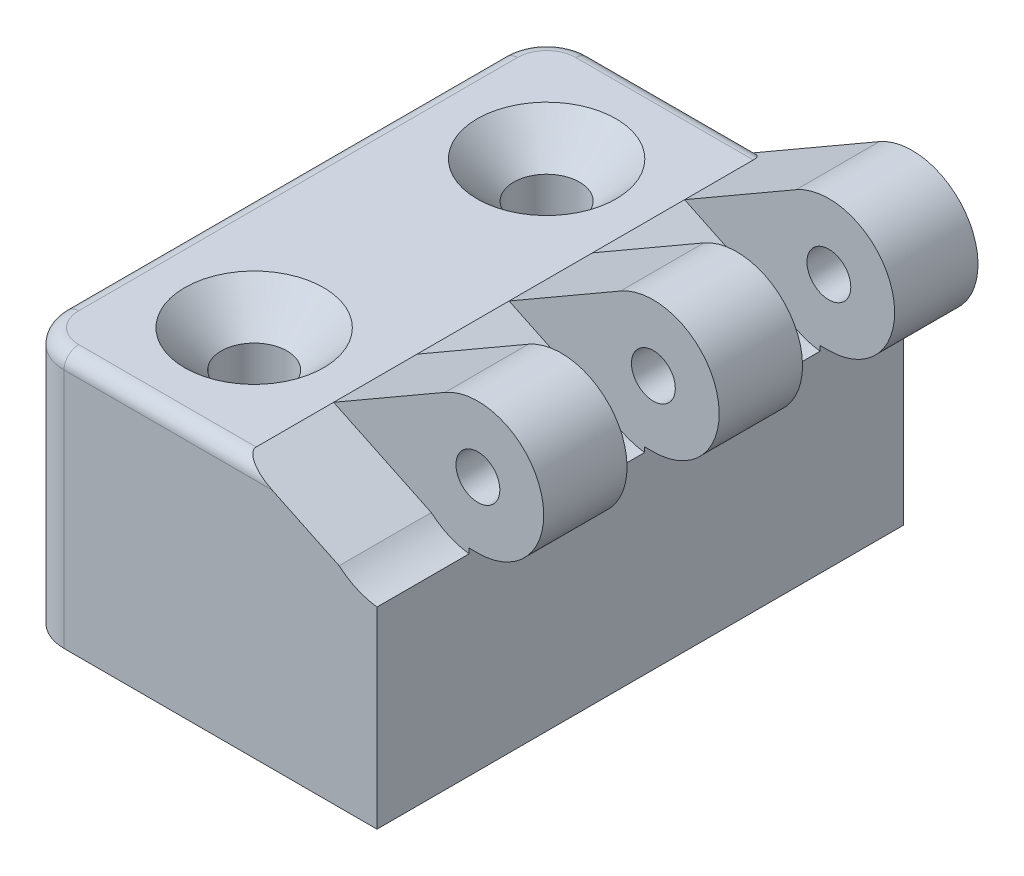
ISO-10303-21;
HEADER;
FILE_DESCRIPTION(('STEP AP214'),'2;1');
FILE_NAME('part.step','',(''),(''),'','','');
FILE_SCHEMA(('AUTOMOTIVE_DESIGN { 1 0 10303 214 1 1 1 1 }'));
ENDSEC;
DATA;
#1=APPLICATION_CONTEXT('core data for automotive mechanical design processes');
#2=APPLICATION_PROTOCOL_DEFINITION('international standard','automotive_design',2000,#1);
#3=PRODUCT_CONTEXT('',#1,'mechanical');
#4=PRODUCT('Part','Part','',(#3));
#5=PRODUCT_RELATED_PRODUCT_CATEGORY('part','',(#4));
#6=PRODUCT_DEFINITION_FORMATION('','',#4);
#7=PRODUCT_DEFINITION_CONTEXT('part definition',#1,'design');
#8=PRODUCT_DEFINITION('design','',#6,#7);
#9=PRODUCT_DEFINITION_SHAPE('','',#8);
#10=(LENGTH_UNIT() NAMED_UNIT(*) SI_UNIT(.MILLI.,.METRE.));
#11=(NAMED_UNIT(*) PLANE_ANGLE_UNIT() SI_UNIT($,.RADIAN.));
#12=(NAMED_UNIT(*) SI_UNIT($,.STERADIAN.) SOLID_ANGLE_UNIT());
#13=UNCERTAINTY_MEASURE_WITH_UNIT(LENGTH_MEASURE(1.E-05),#10,'distance_accuracy_value','');
#14=(GEOMETRIC_REPRESENTATION_CONTEXT(3) GLOBAL_UNCERTAINTY_ASSIGNED_CONTEXT((#13)) GLOBAL_UNIT_ASSIGNED_CONTEXT((#10,
#11,#12)) REPRESENTATION_CONTEXT('',''));
#15=CARTESIAN_POINT('',(0.,0.,0.));
#16=DIRECTION('',(0.,0.,1.));
#17=DIRECTION('',(1.,0.,0.));
#18=AXIS2_PLACEMENT_3D('',#15,#16,#17);
#19=CARTESIAN_POINT('',(12.75,7.89711431702908,-36.));
#20=DIRECTION('',(-0.499999999999995,0.866025403784442,0.));
#21=DIRECTION('',(-0.866025403784442,-0.499999999999995,0.));
#22=AXIS2_PLACEMENT_3D('',#19,#20,#21);
#23=PLANE('',#22);
#24=DIRECTION('',(-0.866025403784442,-0.499999999999995,0.));
#25=VECTOR('',#24,1.);
#26=CARTESIAN_POINT('',(12.75,7.89711431702908,-36.));
#27=LINE('',#26,#25);
#28=CARTESIAN_POINT('',(12.75,7.89711431702908,-36.));
#29=VERTEX_POINT('',#28);
#30=CARTESIAN_POINT('',(3.40192378864723,2.49999999999948,-36.));
#31=VERTEX_POINT('',#30);
#32=EDGE_CURVE('E439',#29,#31,#27,.T.);
#33=ORIENTED_EDGE('',*,*,#32,.T.);
#34=CARTESIAN_POINT('',(3.40192378864724,2.49999999999948,-35.));
#35=DIRECTION('',(-0.499999999999995,0.866025403784442,0.));
#36=DIRECTION('',(0.866025403784442,0.499999999999995,0.));
#37=AXIS2_PLACEMENT_3D('',#34,#35,#36);
#38=ELLIPSE('',#37,2.00000000000002,1.);
#39=CARTESIAN_POINT('',(5.13397459621614,3.49999999999948,-35.));
#40=VERTEX_POINT('',#39);
#41=EDGE_CURVE('E11',#31,#40,#38,.F.);
#42=ORIENTED_EDGE('',*,*,#41,.T.);
#43=DIRECTION('',(0.,0.,1.));
#44=VECTOR('',#43,1.);
#45=CARTESIAN_POINT('',(5.13397459621614,3.49999999999948,-36.));
#46=LINE('',#45,#44);
#47=CARTESIAN_POINT('',(5.13397459621614,3.49999999999948,-30.3));
#48=VERTEX_POINT('',#47);
#49=EDGE_CURVE('E446',#40,#48,#46,.T.);
#50=ORIENTED_EDGE('',*,*,#49,.T.);
#51=DIRECTION('',(-0.866025403784442,-0.499999999999995,0.));
#52=VECTOR('',#51,1.);
#53=CARTESIAN_POINT('',(12.75,7.89711431702908,-30.3));
#54=LINE('',#53,#52);
#55=CARTESIAN_POINT('',(12.75,7.89711431702908,-30.3));
#56=VERTEX_POINT('',#55);
#57=EDGE_CURVE('E270',#56,#48,#54,.T.);
#58=ORIENTED_EDGE('',*,*,#57,.F.);
#59=DIRECTION('',(0.,0.,1.));
#60=VECTOR('',#59,1.);
#61=CARTESIAN_POINT('',(12.75,7.89711431702908,-36.));
#62=LINE('',#61,#60);
#63=EDGE_CURVE('E452',#29,#56,#62,.T.);
#64=ORIENTED_EDGE('',*,*,#63,.F.);
#65=EDGE_LOOP('',(#33,#42,#50,#58,#64));
#66=FACE_BOUND('',#65,.T.);
#67=ADVANCED_FACE('F41',(#66),#23,.T.);
#68=CARTESIAN_POINT('',(15.,3.99999999999909,-36.));
#69=DIRECTION('',(0.,0.,1.));
#70=DIRECTION('',(1.,0.,0.));
#71=AXIS2_PLACEMENT_3D('',#68,#69,#70);
#72=CYLINDRICAL_SURFACE('',#71,4.5);
#73=ORIENTED_EDGE('',*,*,#63,.T.);
#74=CARTESIAN_POINT('',(15.,3.99999999999909,-30.3));
#75=DIRECTION('',(0.,0.,1.));
#76=DIRECTION('',(1.,0.,0.));
#77=AXIS2_PLACEMENT_3D('',#74,#75,#76);
#78=CIRCLE('',#77,4.5);
#79=CARTESIAN_POINT('',(14.9999999999995,-0.500000000000907,-30.3));
#80=VERTEX_POINT('',#79);
#81=EDGE_CURVE('E267',#80,#56,#78,.T.);
#82=ORIENTED_EDGE('',*,*,#81,.F.);
#83=DIRECTION('',(0.,0.,1.));
#84=VECTOR('',#83,1.);
#85=CARTESIAN_POINT('',(14.9999999999995,-0.500000000000907,-36.));
#86=LINE('',#85,#84);
#87=CARTESIAN_POINT('',(14.9999999999995,-0.500000000000907,-36.));
#88=VERTEX_POINT('',#87);
#89=EDGE_CURVE('E458',#88,#80,#86,.T.);
#90=ORIENTED_EDGE('',*,*,#89,.F.);
#91=CARTESIAN_POINT('',(15.,3.99999999999909,-36.));
#92=DIRECTION('',(0.,0.,1.));
#93=DIRECTION('',(1.,0.,0.));
#94=AXIS2_PLACEMENT_3D('',#91,#92,#93);
#95=CIRCLE('',#94,4.5);
#96=EDGE_CURVE('E435',#88,#29,#95,.T.);
#97=ORIENTED_EDGE('',*,*,#96,.T.);
#98=EDGE_LOOP('',(#73,#82,#90,#97));
#99=FACE_BOUND('',#98,.T.);
#100=ADVANCED_FACE('F672',(#99),#72,.T.);
#101=CARTESIAN_POINT('',(14.9999999999995,-0.500000000000907,-36.));
#102=DIRECTION('',(0.,-1.,0.));
#103=DIRECTION('',(1.,0.,0.));
#104=AXIS2_PLACEMENT_3D('',#101,#102,#103);
#105=PLANE('',#104);
#106=ORIENTED_EDGE('',*,*,#89,.T.);
#107=DIRECTION('',(-1.,0.,0.));
#108=VECTOR('',#107,1.);
#109=CARTESIAN_POINT('',(14.9999999999995,-0.500000000000907,-30.3));
#110=LINE('',#109,#108);
#111=CARTESIAN_POINT('',(14.3999999999995,-0.500000000000907,-30.3));
#112=VERTEX_POINT('',#111);
#113=EDGE_CURVE('E315',#80,#112,#110,.T.);
#114=ORIENTED_EDGE('',*,*,#113,.T.);
#115=DIRECTION('',(0.,0.,1.));
#116=VECTOR('',#115,1.);
#117=CARTESIAN_POINT('',(14.3999999999995,-0.500000000000907,-36.));
#118=LINE('',#117,#116);
#119=CARTESIAN_POINT('',(14.3999999999995,-0.500000000000907,-36.));
#120=VERTEX_POINT('',#119);
#121=EDGE_CURVE('E464',#120,#112,#118,.T.);
#122=ORIENTED_EDGE('',*,*,#121,.F.);
#123=DIRECTION('',(1.,0.,0.));
#124=VECTOR('',#123,1.);
#125=CARTESIAN_POINT('',(14.9999999999995,-0.500000000000907,-36.));
#126=LINE('',#125,#124);
#127=EDGE_CURVE('E431',#120,#88,#126,.T.);
#128=ORIENTED_EDGE('',*,*,#127,.T.);
#129=EDGE_LOOP('',(#106,#114,#122,#128));
#130=FACE_BOUND('',#129,.T.);
#131=ADVANCED_FACE('F677',(#130),#105,.T.);
#132=CARTESIAN_POINT('',(15.,3.99999999999909,-36.));
#133=DIRECTION('',(0.,0.,1.));
#134=DIRECTION('',(1.,0.,0.));
#135=AXIS2_PLACEMENT_3D('',#132,#133,#134);
#136=CYLINDRICAL_SURFACE('',#135,1.5);
#137=CARTESIAN_POINT('',(15.,3.99999999999909,-36.));
#138=DIRECTION('',(0.,0.,1.));
#139=DIRECTION('',(1.,0.,0.));
#140=AXIS2_PLACEMENT_3D('',#137,#138,#139);
#141=CIRCLE('',#140,1.5);
#142=CARTESIAN_POINT('',(16.5,3.99999999999909,-36.));
#143=VERTEX_POINT('',#142);
#144=EDGE_CURVE('E422',#143,#143,#141,.T.);
#145=ORIENTED_EDGE('',*,*,#144,.F.);
#146=EDGE_LOOP('',(#145));
#147=FACE_BOUND('',#146,.T.);
#148=CARTESIAN_POINT('',(15.,3.99999999999909,-30.3));
#149=DIRECTION('',(0.,0.,1.));
#150=DIRECTION('',(1.,0.,0.));
#151=AXIS2_PLACEMENT_3D('',#148,#149,#150);
#152=CIRCLE('',#151,1.5);
#153=CARTESIAN_POINT('',(16.5,3.99999999999909,-30.3));
#154=VERTEX_POINT('',#153);
#155=EDGE_CURVE('E319',#154,#154,#152,.F.);
#156=ORIENTED_EDGE('',*,*,#155,.F.);
#157=EDGE_LOOP('',(#156));
#158=FACE_BOUND('',#157,.T.);
#159=ADVANCED_FACE('F691',(#147,#158),#136,.F.);
#160=CARTESIAN_POINT('',(14.3999999999995,-0.500000000000907,-36.));
#161=DIRECTION('',(1.,0.,0.));
#162=DIRECTION('',(0.,1.,0.));
#163=AXIS2_PLACEMENT_3D('',#160,#161,#162);
#164=PLANE('',#163);
#165=ORIENTED_EDGE('',*,*,#121,.T.);
#166=DIRECTION('',(0.,-1.,0.));
#167=VECTOR('',#166,1.);
#168=CARTESIAN_POINT('',(14.3999999999995,-0.500000000000907,-30.3));
#169=LINE('',#168,#167);
#170=CARTESIAN_POINT('',(14.3999999999996,-0.842600763875235,-30.3));
#171=VERTEX_POINT('',#170);
#172=EDGE_CURVE('E481',#112,#171,#169,.T.);
#173=ORIENTED_EDGE('',*,*,#172,.T.);
#174=DIRECTION('',(0.,0.,1.));
#175=VECTOR('',#174,1.);
#176=CARTESIAN_POINT('',(14.3999999999996,-0.842600763875235,-30.3));
#177=LINE('',#176,#175);
#178=CARTESIAN_POINT('',(14.3999999999996,-0.842600763875235,-24.));
#179=VERTEX_POINT('',#178);
#180=EDGE_CURVE('E299',#171,#179,#177,.T.);
#181=ORIENTED_EDGE('',*,*,#180,.T.);
#182=DIRECTION('',(0.,-1.,0.));
#183=VECTOR('',#182,1.);
#184=CARTESIAN_POINT('',(14.3999999999995,-0.500000000000907,-24.));
#185=LINE('',#184,#183);
#186=CARTESIAN_POINT('',(14.3999999999995,-0.500000000000907,-24.));
#187=VERTEX_POINT('',#186);
#188=EDGE_CURVE('E478',#187,#179,#185,.T.);
#189=ORIENTED_EDGE('',*,*,#188,.F.);
#190=CARTESIAN_POINT('',(14.3999999999995,-0.500000000000907,-18.3));
#191=VERTEX_POINT('',#190);
#192=EDGE_CURVE('E468',#187,#191,#118,.T.);
#193=ORIENTED_EDGE('',*,*,#192,.T.);
#194=DIRECTION('',(0.,-1.,0.));
#195=VECTOR('',#194,1.);
#196=CARTESIAN_POINT('',(14.3999999999995,-0.500000000000907,-18.3));
#197=LINE('',#196,#195);
#198=CARTESIAN_POINT('',(14.3999999999996,-0.842600763875235,-18.3));
#199=VERTEX_POINT('',#198);
#200=EDGE_CURVE('E474',#191,#199,#197,.T.);
#201=ORIENTED_EDGE('',*,*,#200,.T.);
#202=DIRECTION('',(0.,0.,1.));
#203=VECTOR('',#202,1.);
#204=CARTESIAN_POINT('',(14.3999999999996,-0.842600763875235,-18.3));
#205=LINE('',#204,#203);
#206=CARTESIAN_POINT('',(14.3999999999996,-0.842600763875235,-12.));
#207=VERTEX_POINT('',#206);
#208=EDGE_CURVE('E356',#199,#207,#205,.T.);
#209=ORIENTED_EDGE('',*,*,#208,.T.);
#210=DIRECTION('',(0.,-1.,0.));
#211=VECTOR('',#210,1.);
#212=CARTESIAN_POINT('',(14.3999999999995,-0.500000000000907,-12.));
#213=LINE('',#212,#211);
#214=CARTESIAN_POINT('',(14.3999999999995,-0.500000000000907,-12.));
#215=VERTEX_POINT('',#214);
#216=EDGE_CURVE('E449',#215,#207,#213,.T.);
#217=ORIENTED_EDGE('',*,*,#216,.F.);
#218=CARTESIAN_POINT('',(14.3999999999995,-0.500000000000907,-6.3));
#219=VERTEX_POINT('',#218);
#220=EDGE_CURVE('E442',#215,#219,#118,.T.);
#221=ORIENTED_EDGE('',*,*,#220,.T.);
#222=DIRECTION('',(0.,-1.,0.));
#223=VECTOR('',#222,1.);
#224=CARTESIAN_POINT('',(14.3999999999995,-0.500000000000907,-6.3));
#225=LINE('',#224,#223);
#226=CARTESIAN_POINT('',(14.3999999999996,-0.842600763875235,-6.3));
#227=VERTEX_POINT('',#226);
#228=EDGE_CURVE('E414',#219,#227,#225,.T.);
#229=ORIENTED_EDGE('',*,*,#228,.T.);
#230=DIRECTION('',(0.,0.,1.));
#231=VECTOR('',#230,1.);
#232=CARTESIAN_POINT('',(14.3999999999996,-0.842600763875235,-6.3));
#233=LINE('',#232,#231);
#234=CARTESIAN_POINT('',(14.3999999999996,-0.842600763875235,0.));
#235=VERTEX_POINT('',#234);
#236=EDGE_CURVE('E403',#227,#235,#233,.T.);
#237=ORIENTED_EDGE('',*,*,#236,.T.);
#238=DIRECTION('',(0.,1.,0.));
#239=VECTOR('',#238,1.);
#240=CARTESIAN_POINT('',(14.3999999999995,-0.500000000000907,0.));
#241=LINE('',#240,#239);
#242=CARTESIAN_POINT('',(14.3999999999997,-14.0000000000005,0.));
#243=VERTEX_POINT('',#242);
#244=EDGE_CURVE('E426',#243,#235,#241,.T.);
#245=ORIENTED_EDGE('',*,*,#244,.F.);
#246=DIRECTION('',(0.,0.,1.));
#247=VECTOR('',#246,1.);
#248=CARTESIAN_POINT('',(14.3999999999997,-14.0000000000005,-36.));
#249=LINE('',#248,#247);
#250=CARTESIAN_POINT('',(14.3999999999997,-14.0000000000005,-36.));
#251=VERTEX_POINT('',#250);
#252=EDGE_CURVE('E261',#251,#243,#249,.T.);
#253=ORIENTED_EDGE('',*,*,#252,.F.);
#254=DIRECTION('',(0.,1.,0.));
#255=VECTOR('',#254,1.);
#256=CARTESIAN_POINT('',(14.3999999999995,-0.500000000000907,-36.));
#257=LINE('',#256,#255);
#258=EDGE_CURVE('E427',#251,#120,#257,.T.);
#259=ORIENTED_EDGE('',*,*,#258,.T.);
#260=EDGE_LOOP('',(#165,#173,#181,#189,#193,#201,#209,#217,#221,#229,#237,#245,#253,#259));
#261=FACE_BOUND('',#260,.T.);
#262=ADVANCED_FACE('F621',(#261),#164,.T.);
#263=DIRECTION('',(-0.866025403784442,-0.499999999999995,0.));
#264=VECTOR('',#263,1.);
#265=CARTESIAN_POINT('',(12.75,7.89711431702908,-24.));
#266=LINE('',#265,#264);
#267=CARTESIAN_POINT('',(12.75,7.89711431702908,-24.));
#268=VERTEX_POINT('',#267);
#269=CARTESIAN_POINT('',(5.13397459621614,3.49999999999948,-24.));
#270=VERTEX_POINT('',#269);
#271=EDGE_CURVE('E288',#268,#270,#266,.T.);
#272=ORIENTED_EDGE('',*,*,#271,.T.);
#273=CARTESIAN_POINT('',(5.13397459621614,3.49999999999948,-18.3));
#274=VERTEX_POINT('',#273);
#275=EDGE_CURVE('E450',#270,#274,#46,.T.);
#276=ORIENTED_EDGE('',*,*,#275,.T.);
#277=DIRECTION('',(-0.866025403784442,-0.499999999999995,0.));
#278=VECTOR('',#277,1.);
#279=CARTESIAN_POINT('',(12.75,7.89711431702908,-18.3));
#280=LINE('',#279,#278);
#281=CARTESIAN_POINT('',(12.75,7.89711431702908,-18.3));
#282=VERTEX_POINT('',#281);
#283=EDGE_CURVE('E328',#282,#274,#280,.T.);
#284=ORIENTED_EDGE('',*,*,#283,.F.);
#285=EDGE_CURVE('E456',#268,#282,#62,.T.);
#286=ORIENTED_EDGE('',*,*,#285,.F.);
#287=EDGE_LOOP('',(#272,#276,#284,#286));
#288=FACE_BOUND('',#287,.T.);
#289=ADVANCED_FACE('F586',(#288),#23,.T.);
#290=CARTESIAN_POINT('',(15.,3.99999999999909,-24.));
#291=DIRECTION('',(0.,0.,1.));
#292=DIRECTION('',(1.,0.,0.));
#293=AXIS2_PLACEMENT_3D('',#290,#291,#292);
#294=CIRCLE('',#293,4.5);
#295=CARTESIAN_POINT('',(14.9999999999995,-0.500000000000907,-24.));
#296=VERTEX_POINT('',#295);
#297=EDGE_CURVE('E284',#296,#268,#294,.T.);
#298=ORIENTED_EDGE('',*,*,#297,.T.);
#299=ORIENTED_EDGE('',*,*,#285,.T.);
#300=CARTESIAN_POINT('',(15.,3.99999999999909,-18.3));
#301=DIRECTION('',(0.,0.,1.));
#302=DIRECTION('',(1.,0.,0.));
#303=AXIS2_PLACEMENT_3D('',#300,#301,#302);
#304=CIRCLE('',#303,4.5);
#305=CARTESIAN_POINT('',(14.9999999999995,-0.500000000000907,-18.3));
#306=VERTEX_POINT('',#305);
#307=EDGE_CURVE('E324',#306,#282,#304,.T.);
#308=ORIENTED_EDGE('',*,*,#307,.F.);
#309=EDGE_CURVE('E462',#296,#306,#86,.T.);
#310=ORIENTED_EDGE('',*,*,#309,.F.);
#311=EDGE_LOOP('',(#298,#299,#308,#310));
#312=FACE_BOUND('',#311,.T.);
#313=ADVANCED_FACE('F601',(#312),#72,.T.);
#314=DIRECTION('',(-1.,0.,0.));
#315=VECTOR('',#314,1.);
#316=CARTESIAN_POINT('',(14.9999999999995,-0.500000000000907,-24.));
#317=LINE('',#316,#315);
#318=EDGE_CURVE('E303',#296,#187,#317,.T.);
#319=ORIENTED_EDGE('',*,*,#318,.F.);
#320=ORIENTED_EDGE('',*,*,#309,.T.);
#321=DIRECTION('',(-1.,0.,0.));
#322=VECTOR('',#321,1.);
#323=CARTESIAN_POINT('',(14.9999999999995,-0.500000000000907,-18.3));
#324=LINE('',#323,#322);
#325=EDGE_CURVE('E372',#306,#191,#324,.T.);
#326=ORIENTED_EDGE('',*,*,#325,.T.);
#327=ORIENTED_EDGE('',*,*,#192,.F.);
#328=EDGE_LOOP('',(#319,#320,#326,#327));
#329=FACE_BOUND('',#328,.T.);
#330=ADVANCED_FACE('F624',(#329),#105,.T.);
#331=CARTESIAN_POINT('',(15.,3.99999999999909,-24.));
#332=DIRECTION('',(0.,0.,1.));
#333=DIRECTION('',(1.,0.,0.));
#334=AXIS2_PLACEMENT_3D('',#331,#332,#333);
#335=CIRCLE('',#334,1.5);
#336=CARTESIAN_POINT('',(16.5,3.99999999999909,-24.));
#337=VERTEX_POINT('',#336);
#338=EDGE_CURVE('E311',#337,#337,#335,.F.);
#339=ORIENTED_EDGE('',*,*,#338,.T.);
#340=EDGE_LOOP('',(#339));
#341=FACE_BOUND('',#340,.T.);
#342=CARTESIAN_POINT('',(15.,3.99999999999909,-18.3));
#343=DIRECTION('',(0.,0.,1.));
#344=DIRECTION('',(1.,0.,0.));
#345=AXIS2_PLACEMENT_3D('',#342,#343,#344);
#346=CIRCLE('',#345,1.5);
#347=CARTESIAN_POINT('',(16.5,3.99999999999909,-18.3));
#348=VERTEX_POINT('',#347);
#349=EDGE_CURVE('E376',#348,#348,#346,.F.);
#350=ORIENTED_EDGE('',*,*,#349,.F.);
#351=EDGE_LOOP('',(#350));
#352=FACE_BOUND('',#351,.T.);
#353=ADVANCED_FACE('F683',(#341,#352),#136,.F.);
#354=DIRECTION('',(-0.866025403784442,-0.499999999999995,0.));
#355=VECTOR('',#354,1.);
#356=CARTESIAN_POINT('',(12.75,7.89711431702908,-12.));
#357=LINE('',#356,#355);
#358=CARTESIAN_POINT('',(12.75,7.89711431702908,-12.));
#359=VERTEX_POINT('',#358);
#360=CARTESIAN_POINT('',(5.13397459621614,3.49999999999948,-12.));
#361=VERTEX_POINT('',#360);
#362=EDGE_CURVE('E345',#359,#361,#357,.T.);
#363=ORIENTED_EDGE('',*,*,#362,.T.);
#364=CARTESIAN_POINT('',(5.13397459621614,3.49999999999948,-6.3));
#365=VERTEX_POINT('',#364);
#366=EDGE_CURVE('E451',#361,#365,#46,.T.);
#367=ORIENTED_EDGE('',*,*,#366,.T.);
#368=DIRECTION('',(-0.866025403784442,-0.499999999999995,0.));
#369=VECTOR('',#368,1.);
#370=CARTESIAN_POINT('',(12.75,7.89711431702908,-6.3));
#371=LINE('',#370,#369);
#372=CARTESIAN_POINT('',(12.75,7.89711431702908,-6.3));
#373=VERTEX_POINT('',#372);
#374=EDGE_CURVE('E385',#373,#365,#371,.T.);
#375=ORIENTED_EDGE('',*,*,#374,.F.);
#376=EDGE_CURVE('E457',#359,#373,#62,.T.);
#377=ORIENTED_EDGE('',*,*,#376,.F.);
#378=EDGE_LOOP('',(#363,#367,#375,#377));
#379=FACE_BOUND('',#378,.T.);
#380=ADVANCED_FACE('F578',(#379),#23,.T.);
#381=CARTESIAN_POINT('',(15.,3.99999999999909,-12.));
#382=DIRECTION('',(0.,0.,1.));
#383=DIRECTION('',(1.,0.,0.));
#384=AXIS2_PLACEMENT_3D('',#381,#382,#383);
#385=CIRCLE('',#384,4.5);
#386=CARTESIAN_POINT('',(14.9999999999995,-0.500000000000907,-12.));
#387=VERTEX_POINT('',#386);
#388=EDGE_CURVE('E323',#387,#359,#385,.T.);
#389=ORIENTED_EDGE('',*,*,#388,.T.);
#390=ORIENTED_EDGE('',*,*,#376,.T.);
#391=CARTESIAN_POINT('',(15.,3.99999999999909,-6.3));
#392=DIRECTION('',(0.,0.,1.));
#393=DIRECTION('',(1.,0.,0.));
#394=AXIS2_PLACEMENT_3D('',#391,#392,#393);
#395=CIRCLE('',#394,4.5);
#396=CARTESIAN_POINT('',(14.9999999999995,-0.500000000000907,-6.3));
#397=VERTEX_POINT('',#396);
#398=EDGE_CURVE('E381',#397,#373,#395,.T.);
#399=ORIENTED_EDGE('',*,*,#398,.F.);
#400=EDGE_CURVE('E463',#387,#397,#86,.T.);
#401=ORIENTED_EDGE('',*,*,#400,.F.);
#402=EDGE_LOOP('',(#389,#390,#399,#401));
#403=FACE_BOUND('',#402,.T.);
#404=ADVANCED_FACE('F605',(#403),#72,.T.);
#405=DIRECTION('',(-1.,0.,0.));
#406=VECTOR('',#405,1.);
#407=CARTESIAN_POINT('',(14.9999999999995,-0.500000000000907,-12.));
#408=LINE('',#407,#406);
#409=EDGE_CURVE('E360',#387,#215,#408,.T.);
#410=ORIENTED_EDGE('',*,*,#409,.F.);
#411=ORIENTED_EDGE('',*,*,#400,.T.);
#412=DIRECTION('',(-1.,0.,0.));
#413=VECTOR('',#412,1.);
#414=CARTESIAN_POINT('',(14.9999999999995,-0.500000000000907,-6.3));
#415=LINE('',#414,#413);
#416=EDGE_CURVE('E418',#397,#219,#415,.T.);
#417=ORIENTED_EDGE('',*,*,#416,.T.);
#418=ORIENTED_EDGE('',*,*,#220,.F.);
#419=EDGE_LOOP('',(#410,#411,#417,#418));
#420=FACE_BOUND('',#419,.T.);
#421=ADVANCED_FACE('F614',(#420),#105,.T.);
#422=CARTESIAN_POINT('',(15.,3.99999999999909,-12.));
#423=DIRECTION('',(0.,0.,1.));
#424=DIRECTION('',(1.,0.,0.));
#425=AXIS2_PLACEMENT_3D('',#422,#423,#424);
#426=CIRCLE('',#425,1.5);
#427=CARTESIAN_POINT('',(16.5,3.99999999999909,-12.));
#428=VERTEX_POINT('',#427);
#429=EDGE_CURVE('E368',#428,#428,#426,.F.);
#430=ORIENTED_EDGE('',*,*,#429,.T.);
#431=EDGE_LOOP('',(#430));
#432=FACE_BOUND('',#431,.T.);
#433=CARTESIAN_POINT('',(15.,3.99999999999909,-6.3));
#434=DIRECTION('',(0.,0.,1.));
#435=DIRECTION('',(1.,0.,0.));
#436=AXIS2_PLACEMENT_3D('',#433,#434,#435);
#437=CIRCLE('',#436,1.5);
#438=CARTESIAN_POINT('',(16.5,3.99999999999909,-6.3));
#439=VERTEX_POINT('',#438);
#440=EDGE_CURVE('E407',#439,#439,#437,.F.);
#441=ORIENTED_EDGE('',*,*,#440,.F.);
#442=EDGE_LOOP('',(#441));
#443=FACE_BOUND('',#442,.T.);
#444=ADVANCED_FACE('F690',(#432,#443),#136,.F.);
#445=CARTESIAN_POINT('',(-9.99999999999999,-4.00000000000065,-36.));
#446=DIRECTION('',(-1.,0.,0.));
#447=DIRECTION('',(0.,0.,1.));
#448=AXIS2_PLACEMENT_3D('',#445,#446,#447);
#449=PLANE('',#448);
#450=DIRECTION('',(0.,-1.,0.));
#451=VECTOR('',#450,1.);
#452=CARTESIAN_POINT('',(-9.99999999999999,-4.00000000000065,-3.));
#453=LINE('',#452,#451);
#454=CARTESIAN_POINT('',(-9.99999999999994,-14.0000000000006,-3.));
#455=VERTEX_POINT('',#454);
#456=CARTESIAN_POINT('',(-9.99999999999999,2.49999999999948,-3.));
#457=VERTEX_POINT('',#456);
#458=EDGE_CURVE('E219',#455,#457,#453,.F.);
#459=ORIENTED_EDGE('',*,*,#458,.T.);
#460=DIRECTION('',(0.,0.,1.));
#461=VECTOR('',#460,1.);
#462=CARTESIAN_POINT('',(-9.99999999999999,2.49999999999948,-36.));
#463=LINE('',#462,#461);
#464=CARTESIAN_POINT('',(-9.99999999999999,2.49999999999948,-33.));
#465=VERTEX_POINT('',#464);
#466=EDGE_CURVE('E51',#457,#465,#463,.F.);
#467=ORIENTED_EDGE('',*,*,#466,.T.);
#468=DIRECTION('',(0.,-1.,0.));
#469=VECTOR('',#468,1.);
#470=CARTESIAN_POINT('',(-9.99999999999999,-4.00000000000065,-33.));
#471=LINE('',#470,#469);
#472=CARTESIAN_POINT('',(-9.99999999999994,-14.0000000000006,-33.));
#473=VERTEX_POINT('',#472);
#474=EDGE_CURVE('E227',#465,#473,#471,.T.);
#475=ORIENTED_EDGE('',*,*,#474,.T.);
#476=DIRECTION('',(0.,0.,-1.));
#477=VECTOR('',#476,1.);
#478=CARTESIAN_POINT('',(-9.99999999999994,-14.0000000000006,-3.));
#479=LINE('',#478,#477);
#480=EDGE_CURVE('E231',#455,#473,#479,.T.);
#481=ORIENTED_EDGE('',*,*,#480,.F.);
#482=EDGE_LOOP('',(#459,#467,#475,#481));
#483=FACE_BOUND('',#482,.T.);
#484=ADVANCED_FACE('F232',(#483),#449,.T.);
#485=CARTESIAN_POINT('',(-9.99999999999999,3.49999999999948,-36.));
#486=DIRECTION('',(0.,1.,0.));
#487=DIRECTION('',(-1.,0.,0.));
#488=AXIS2_PLACEMENT_3D('',#485,#486,#487);
#489=PLANE('',#488);
#490=ORIENTED_EDGE('',*,*,#49,.F.);
#491=DIRECTION('',(-1.,0.,0.));
#492=VECTOR('',#491,1.);
#493=CARTESIAN_POINT('',(-6.99999999999999,3.49999999999948,-35.));
#494=LINE('',#493,#492);
#495=CARTESIAN_POINT('',(-6.99999999999999,3.49999999999948,-35.));
#496=VERTEX_POINT('',#495);
#497=EDGE_CURVE('E521',#40,#496,#494,.T.);
#498=ORIENTED_EDGE('',*,*,#497,.T.);
#499=CARTESIAN_POINT('',(-6.99999999999999,3.49999999999948,-33.));
#500=DIRECTION('',(0.,1.,0.));
#501=DIRECTION('',(-1.,0.,0.));
#502=AXIS2_PLACEMENT_3D('',#499,#500,#501);
#503=CIRCLE('',#502,2.);
#504=CARTESIAN_POINT('',(-8.99999999999999,3.49999999999948,-33.));
#505=VERTEX_POINT('',#504);
#506=EDGE_CURVE('E518',#496,#505,#503,.T.);
#507=ORIENTED_EDGE('',*,*,#506,.T.);
#508=DIRECTION('',(0.,0.,1.));
#509=VECTOR('',#508,1.);
#510=CARTESIAN_POINT('',(-8.99999999999999,3.49999999999948,-36.));
#511=LINE('',#510,#509);
#512=CARTESIAN_POINT('',(-8.99999999999999,3.49999999999948,-3.));
#513=VERTEX_POINT('',#512);
#514=EDGE_CURVE('E509',#505,#513,#511,.T.);
#515=ORIENTED_EDGE('',*,*,#514,.T.);
#516=CARTESIAN_POINT('',(-6.99999999999999,3.49999999999948,-3.));
#517=DIRECTION('',(0.,1.,0.));
#518=DIRECTION('',(-1.,0.,0.));
#519=AXIS2_PLACEMENT_3D('',#516,#517,#518);
#520=CIRCLE('',#519,2.);
#521=CARTESIAN_POINT('',(-6.99999999999999,3.49999999999948,-1.));
#522=VERTEX_POINT('',#521);
#523=EDGE_CURVE('E512',#513,#522,#520,.T.);
#524=ORIENTED_EDGE('',*,*,#523,.T.);
#525=DIRECTION('',(-1.,0.,0.));
#526=VECTOR('',#525,1.);
#527=CARTESIAN_POINT('',(-9.99999999999999,3.49999999999948,-1.));
#528=LINE('',#527,#526);
#529=CARTESIAN_POINT('',(5.13397459621614,3.49999999999948,-1.));
#530=VERTEX_POINT('',#529);
#531=EDGE_CURVE('E515',#522,#530,#528,.F.);
#532=ORIENTED_EDGE('',*,*,#531,.T.);
#533=DIRECTION('',(0.,0.,1.));
#534=VECTOR('',#533,1.);
#535=CARTESIAN_POINT('',(5.13397459621614,3.49999999999948,-6.3));
#536=LINE('',#535,#534);
#537=EDGE_CURVE('E398',#365,#530,#536,.T.);
#538=ORIENTED_EDGE('',*,*,#537,.F.);
#539=ORIENTED_EDGE('',*,*,#366,.F.);
#540=DIRECTION('',(0.,0.,1.));
#541=VECTOR('',#540,1.);
#542=CARTESIAN_POINT('',(5.13397459621614,3.49999999999948,-18.3));
#543=LINE('',#542,#541);
#544=EDGE_CURVE('E341',#274,#361,#543,.T.);
#545=ORIENTED_EDGE('',*,*,#544,.F.);
#546=ORIENTED_EDGE('',*,*,#275,.F.);
#547=DIRECTION('',(0.,0.,1.));
#548=VECTOR('',#547,1.);
#549=CARTESIAN_POINT('',(5.13397459621614,3.49999999999948,-30.3));
#550=LINE('',#549,#548);
#551=EDGE_CURVE('E283',#48,#270,#550,.T.);
#552=ORIENTED_EDGE('',*,*,#551,.F.);
#553=EDGE_LOOP('',(#490,#498,#507,#515,#524,#532,#538,#539,#545,#546,#552));
#554=FACE_BOUND('',#553,.T.);
#555=CARTESIAN_POINT('',(-1.99999999999999,3.49999999999948,-8.));
#556=DIRECTION('',(0.,1.,0.));
#557=DIRECTION('',(-1.,0.,0.));
#558=AXIS2_PLACEMENT_3D('',#555,#556,#557);
#559=CIRCLE('',#558,4.75000000000002);
#560=CARTESIAN_POINT('',(-6.75000000000001,3.49999999999948,-8.));
#561=VERTEX_POINT('',#560);
#562=EDGE_CURVE('E493',#561,#561,#559,.F.);
#563=ORIENTED_EDGE('',*,*,#562,.T.);
#564=EDGE_LOOP('',(#563));
#565=FACE_BOUND('',#564,.T.);
#566=CARTESIAN_POINT('',(-1.99999999999999,3.49999999999948,-28.));
#567=DIRECTION('',(0.,1.,0.));
#568=DIRECTION('',(-1.,0.,0.));
#569=AXIS2_PLACEMENT_3D('',#566,#567,#568);
#570=CIRCLE('',#569,4.75000000000002);
#571=CARTESIAN_POINT('',(-6.75000000000001,3.49999999999948,-28.));
#572=VERTEX_POINT('',#571);
#573=EDGE_CURVE('E489',#572,#572,#570,.F.);
#574=ORIENTED_EDGE('',*,*,#573,.T.);
#575=EDGE_LOOP('',(#574));
#576=FACE_BOUND('',#575,.T.);
#577=ADVANCED_FACE('F564',(#554,#565,#576),#489,.T.);
#578=CARTESIAN_POINT('',(15.,3.99999999999909,-36.));
#579=DIRECTION('',(0.,0.,1.));
#580=DIRECTION('',(1.,0.,0.));
#581=AXIS2_PLACEMENT_3D('',#578,#579,#580);
#582=PLANE('',#581);
#583=ORIENTED_EDGE('',*,*,#144,.T.);
#584=EDGE_LOOP('',(#583));
#585=FACE_BOUND('',#584,.T.);
#586=DIRECTION('',(0.,-1.,0.));
#587=VECTOR('',#586,1.);
#588=CARTESIAN_POINT('',(-6.99999999999999,3.49999999999948,-36.));
#589=LINE('',#588,#587);
#590=CARTESIAN_POINT('',(-6.99999999999994,-14.0000000000006,-36.));
#591=VERTEX_POINT('',#590);
#592=CARTESIAN_POINT('',(-6.99999999999999,2.49999999999948,-36.));
#593=VERTEX_POINT('',#592);
#594=EDGE_CURVE('E502',#591,#593,#589,.F.);
#595=ORIENTED_EDGE('',*,*,#594,.T.);
#596=DIRECTION('',(-1.,0.,0.));
#597=VECTOR('',#596,1.);
#598=CARTESIAN_POINT('',(5.13397459621614,2.49999999999948,-36.));
#599=LINE('',#598,#597);
#600=EDGE_CURVE('E525',#593,#31,#599,.F.);
#601=ORIENTED_EDGE('',*,*,#600,.T.);
#602=ORIENTED_EDGE('',*,*,#32,.F.);
#603=ORIENTED_EDGE('',*,*,#96,.F.);
#604=ORIENTED_EDGE('',*,*,#127,.F.);
#605=ORIENTED_EDGE('',*,*,#258,.F.);
#606=DIRECTION('',(1.,0.,0.));
#607=VECTOR('',#606,1.);
#608=CARTESIAN_POINT('',(-6.99999999999994,-14.0000000000006,-36.));
#609=LINE('',#608,#607);
#610=EDGE_CURVE('E257',#591,#251,#609,.T.);
#611=ORIENTED_EDGE('',*,*,#610,.F.);
#612=EDGE_LOOP('',(#595,#601,#602,#603,#604,#605,#611));
#613=FACE_BOUND('',#612,.T.);
#614=ADVANCED_FACE('F654',(#585,#613),#582,.F.);
#615=CARTESIAN_POINT('',(15.,3.99999999999909,0.));
#616=DIRECTION('',(0.,0.,1.));
#617=DIRECTION('',(1.,0.,0.));
#618=AXIS2_PLACEMENT_3D('',#615,#616,#617);
#619=PLANE('',#618);
#620=DIRECTION('',(0.90220196879568,-0.431313815569591,0.));
#621=VECTOR('',#620,1.);
#622=CARTESIAN_POINT('',(5.13397459621614,3.49999999999948,0.));
#623=LINE('',#622,#621);
#624=CARTESIAN_POINT('',(7.2257275988512,2.49999999999948,0.));
#625=VERTEX_POINT('',#624);
#626=CARTESIAN_POINT('',(11.8076100498392,0.309549002574857,0.));
#627=VERTEX_POINT('',#626);
#628=EDGE_CURVE('E380',#625,#627,#623,.T.);
#629=ORIENTED_EDGE('',*,*,#628,.F.);
#630=DIRECTION('',(-1.,0.,0.));
#631=VECTOR('',#630,1.);
#632=CARTESIAN_POINT('',(15.,2.49999999999948,0.));
#633=LINE('',#632,#631);
#634=CARTESIAN_POINT('',(-6.99999999999999,2.49999999999948,0.));
#635=VERTEX_POINT('',#634);
#636=EDGE_CURVE('E532',#625,#635,#633,.T.);
#637=ORIENTED_EDGE('',*,*,#636,.T.);
#638=DIRECTION('',(0.,-1.,0.));
#639=VECTOR('',#638,1.);
#640=CARTESIAN_POINT('',(-6.99999999999999,3.99999999999909,0.));
#641=LINE('',#640,#639);
#642=CARTESIAN_POINT('',(-6.99999999999994,-14.0000000000006,0.));
#643=VERTEX_POINT('',#642);
#644=EDGE_CURVE('E506',#635,#643,#641,.T.);
#645=ORIENTED_EDGE('',*,*,#644,.T.);
#646=DIRECTION('',(-1.,0.,0.));
#647=VECTOR('',#646,1.);
#648=CARTESIAN_POINT('',(14.3999999999997,-14.0000000000005,0.));
#649=LINE('',#648,#647);
#650=EDGE_CURVE('E245',#243,#643,#649,.T.);
#651=ORIENTED_EDGE('',*,*,#650,.F.);
#652=ORIENTED_EDGE('',*,*,#244,.T.);
#653=CARTESIAN_POINT('',(15.,3.99999999999909,0.));
#654=DIRECTION('',(0.,0.,1.));
#655=DIRECTION('',(-1.,0.,0.));
#656=AXIS2_PLACEMENT_3D('',#653,#654,#655);
#657=CIRCLE('',#656,4.87962930541625);
#658=EDGE_CURVE('E386',#627,#235,#657,.T.);
#659=ORIENTED_EDGE('',*,*,#658,.F.);
#660=EDGE_LOOP('',(#629,#637,#645,#651,#652,#659));
#661=FACE_BOUND('',#660,.T.);
#662=ADVANCED_FACE('F660',(#661),#619,.T.);
#663=CARTESIAN_POINT('',(15.,3.99999999999909,-6.3));
#664=DIRECTION('',(0.,0.,1.));
#665=DIRECTION('',(1.,0.,0.));
#666=AXIS2_PLACEMENT_3D('',#663,#664,#665);
#667=PLANE('',#666);
#668=ORIENTED_EDGE('',*,*,#398,.T.);
#669=ORIENTED_EDGE('',*,*,#374,.T.);
#670=DIRECTION('',(0.90220196879568,-0.431313815569591,0.));
#671=VECTOR('',#670,1.);
#672=CARTESIAN_POINT('',(5.13397459621614,3.49999999999948,-6.3));
#673=LINE('',#672,#671);
#674=CARTESIAN_POINT('',(11.8076100498392,0.309549002574857,-6.3));
#675=VERTEX_POINT('',#674);
#676=EDGE_CURVE('E390',#365,#675,#673,.T.);
#677=ORIENTED_EDGE('',*,*,#676,.T.);
#678=CARTESIAN_POINT('',(15.,3.99999999999909,-6.3));
#679=DIRECTION('',(0.,0.,1.));
#680=DIRECTION('',(-1.,0.,0.));
#681=AXIS2_PLACEMENT_3D('',#678,#679,#680);
#682=CIRCLE('',#681,4.87962930541625);
#683=EDGE_CURVE('E394',#675,#227,#682,.T.);
#684=ORIENTED_EDGE('',*,*,#683,.T.);
#685=ORIENTED_EDGE('',*,*,#228,.F.);
#686=ORIENTED_EDGE('',*,*,#416,.F.);
#687=EDGE_LOOP('',(#668,#669,#677,#684,#685,#686));
#688=FACE_BOUND('',#687,.T.);
#689=ORIENTED_EDGE('',*,*,#440,.T.);
#690=EDGE_LOOP('',(#689));
#691=FACE_BOUND('',#690,.T.);
#692=ADVANCED_FACE('F572',(#688,#691),#667,.T.);
#693=CARTESIAN_POINT('',(15.,3.99999999999909,-6.3));
#694=DIRECTION('',(0.,0.,1.));
#695=DIRECTION('',(1.,0.,0.));
#696=AXIS2_PLACEMENT_3D('',#693,#694,#695);
#697=CYLINDRICAL_SURFACE('',#696,4.87962930541625);
#698=ORIENTED_EDGE('',*,*,#658,.T.);
#699=ORIENTED_EDGE('',*,*,#236,.F.);
#700=ORIENTED_EDGE('',*,*,#683,.F.);
#701=DIRECTION('',(0.,0.,1.));
#702=VECTOR('',#701,1.);
#703=CARTESIAN_POINT('',(11.8076100498392,0.309549002574857,-6.3));
#704=LINE('',#703,#702);
#705=EDGE_CURVE('E408',#675,#627,#704,.T.);
#706=ORIENTED_EDGE('',*,*,#705,.T.);
#707=EDGE_LOOP('',(#698,#699,#700,#706));
#708=FACE_BOUND('',#707,.T.);
#709=ADVANCED_FACE('F662',(#708),#697,.F.);
#710=CARTESIAN_POINT('',(5.13397459621614,3.49999999999948,-6.3));
#711=DIRECTION('',(-0.431313815569591,-0.90220196879568,0.));
#712=DIRECTION('',(0.90220196879568,-0.431313815569591,0.));
#713=AXIS2_PLACEMENT_3D('',#710,#711,#712);
#714=PLANE('',#713);
#715=ORIENTED_EDGE('',*,*,#537,.T.);
#716=CARTESIAN_POINT('',(7.2257275988512,2.49999999999948,-1.));
#717=DIRECTION('',(-0.431313815569591,-0.90220196879568,0.));
#718=DIRECTION('',(-0.90220196879568,0.431313815569591,0.));
#719=AXIS2_PLACEMENT_3D('',#716,#717,#718);
#720=ELLIPSE('',#719,2.31849749278122,1.);
#721=EDGE_CURVE('E67',#530,#625,#720,.F.);
#722=ORIENTED_EDGE('',*,*,#721,.T.);
#723=ORIENTED_EDGE('',*,*,#628,.T.);
#724=ORIENTED_EDGE('',*,*,#705,.F.);
#725=ORIENTED_EDGE('',*,*,#676,.F.);
#726=EDGE_LOOP('',(#715,#722,#723,#724,#725));
#727=FACE_BOUND('',#726,.T.);
#728=ADVANCED_FACE('F568',(#727),#714,.F.);
#729=CARTESIAN_POINT('',(15.,3.99999999999909,-18.3));
#730=DIRECTION('',(0.,0.,1.));
#731=DIRECTION('',(1.,0.,0.));
#732=AXIS2_PLACEMENT_3D('',#729,#730,#731);
#733=PLANE('',#732);
#734=ORIENTED_EDGE('',*,*,#307,.T.);
#735=ORIENTED_EDGE('',*,*,#283,.T.);
#736=DIRECTION('',(0.90220196879568,-0.431313815569591,0.));
#737=VECTOR('',#736,1.);
#738=CARTESIAN_POINT('',(5.13397459621614,3.49999999999948,-18.3));
#739=LINE('',#738,#737);
#740=CARTESIAN_POINT('',(11.8076100498392,0.309549002574857,-18.3));
#741=VERTEX_POINT('',#740);
#742=EDGE_CURVE('E333',#274,#741,#739,.T.);
#743=ORIENTED_EDGE('',*,*,#742,.T.);
#744=CARTESIAN_POINT('',(15.,3.99999999999909,-18.3));
#745=DIRECTION('',(0.,0.,1.));
#746=DIRECTION('',(-1.,0.,0.));
#747=AXIS2_PLACEMENT_3D('',#744,#745,#746);
#748=CIRCLE('',#747,4.87962930541625);
#749=EDGE_CURVE('E337',#741,#199,#748,.T.);
#750=ORIENTED_EDGE('',*,*,#749,.T.);
#751=ORIENTED_EDGE('',*,*,#200,.F.);
#752=ORIENTED_EDGE('',*,*,#325,.F.);
#753=EDGE_LOOP('',(#734,#735,#743,#750,#751,#752));
#754=FACE_BOUND('',#753,.T.);
#755=ORIENTED_EDGE('',*,*,#349,.T.);
#756=EDGE_LOOP('',(#755));
#757=FACE_BOUND('',#756,.T.);
#758=ADVANCED_FACE('F594',(#754,#757),#733,.T.);
#759=CARTESIAN_POINT('',(15.,3.99999999999909,-12.));
#760=DIRECTION('',(0.,0.,1.));
#761=DIRECTION('',(1.,0.,0.));
#762=AXIS2_PLACEMENT_3D('',#759,#760,#761);
#763=PLANE('',#762);
#764=ORIENTED_EDGE('',*,*,#409,.T.);
#765=ORIENTED_EDGE('',*,*,#216,.T.);
#766=CARTESIAN_POINT('',(15.,3.99999999999909,-12.));
#767=DIRECTION('',(0.,0.,1.));
#768=DIRECTION('',(-1.,0.,0.));
#769=AXIS2_PLACEMENT_3D('',#766,#767,#768);
#770=CIRCLE('',#769,4.87962930541625);
#771=CARTESIAN_POINT('',(11.8076100498392,0.309549002574857,-12.));
#772=VERTEX_POINT('',#771);
#773=EDGE_CURVE('E329',#772,#207,#770,.T.);
#774=ORIENTED_EDGE('',*,*,#773,.F.);
#775=DIRECTION('',(0.90220196879568,-0.431313815569591,0.));
#776=VECTOR('',#775,1.);
#777=CARTESIAN_POINT('',(5.13397459621614,3.49999999999948,-12.));
#778=LINE('',#777,#776);
#779=EDGE_CURVE('E349',#361,#772,#778,.T.);
#780=ORIENTED_EDGE('',*,*,#779,.F.);
#781=ORIENTED_EDGE('',*,*,#362,.F.);
#782=ORIENTED_EDGE('',*,*,#388,.F.);
#783=EDGE_LOOP('',(#764,#765,#774,#780,#781,#782));
#784=FACE_BOUND('',#783,.T.);
#785=ORIENTED_EDGE('',*,*,#429,.F.);
#786=EDGE_LOOP('',(#785));
#787=FACE_BOUND('',#786,.T.);
#788=ADVANCED_FACE('F609',(#784,#787),#763,.F.);
#789=CARTESIAN_POINT('',(15.,3.99999999999909,-18.3));
#790=DIRECTION('',(0.,0.,1.));
#791=DIRECTION('',(1.,0.,0.));
#792=AXIS2_PLACEMENT_3D('',#789,#790,#791);
#793=CYLINDRICAL_SURFACE('',#792,4.87962930541625);
#794=ORIENTED_EDGE('',*,*,#773,.T.);
#795=ORIENTED_EDGE('',*,*,#208,.F.);
#796=ORIENTED_EDGE('',*,*,#749,.F.);
#797=DIRECTION('',(0.,0.,1.));
#798=VECTOR('',#797,1.);
#799=CARTESIAN_POINT('',(11.8076100498392,0.309549002574857,-18.3));
#800=LINE('',#799,#798);
#801=EDGE_CURVE('E361',#741,#772,#800,.T.);
#802=ORIENTED_EDGE('',*,*,#801,.T.);
#803=EDGE_LOOP('',(#794,#795,#796,#802));
#804=FACE_BOUND('',#803,.T.);
#805=ADVANCED_FACE('F722',(#804),#793,.F.);
#806=CARTESIAN_POINT('',(5.13397459621614,3.49999999999948,-18.3));
#807=DIRECTION('',(-0.431313815569591,-0.90220196879568,0.));
#808=DIRECTION('',(0.90220196879568,-0.431313815569591,0.));
#809=AXIS2_PLACEMENT_3D('',#806,#807,#808);
#810=PLANE('',#809);
#811=ORIENTED_EDGE('',*,*,#779,.T.);
#812=ORIENTED_EDGE('',*,*,#801,.F.);
#813=ORIENTED_EDGE('',*,*,#742,.F.);
#814=ORIENTED_EDGE('',*,*,#544,.T.);
#815=EDGE_LOOP('',(#811,#812,#813,#814));
#816=FACE_BOUND('',#815,.T.);
#817=ADVANCED_FACE('F590',(#816),#810,.F.);
#818=CARTESIAN_POINT('',(15.,3.99999999999909,-30.3));
#819=DIRECTION('',(0.,0.,1.));
#820=DIRECTION('',(1.,0.,0.));
#821=AXIS2_PLACEMENT_3D('',#818,#819,#820);
#822=PLANE('',#821);
#823=ORIENTED_EDGE('',*,*,#81,.T.);
#824=ORIENTED_EDGE('',*,*,#57,.T.);
#825=DIRECTION('',(0.90220196879568,-0.431313815569591,0.));
#826=VECTOR('',#825,1.);
#827=CARTESIAN_POINT('',(5.13397459621614,3.49999999999948,-30.3));
#828=LINE('',#827,#826);
#829=CARTESIAN_POINT('',(11.8076100498392,0.309549002574857,-30.3));
#830=VERTEX_POINT('',#829);
#831=EDGE_CURVE('E275',#48,#830,#828,.T.);
#832=ORIENTED_EDGE('',*,*,#831,.T.);
#833=CARTESIAN_POINT('',(15.,3.99999999999909,-30.3));
#834=DIRECTION('',(0.,0.,1.));
#835=DIRECTION('',(-1.,0.,0.));
#836=AXIS2_PLACEMENT_3D('',#833,#834,#835);
#837=CIRCLE('',#836,4.87962930541625);
#838=EDGE_CURVE('E279',#830,#171,#837,.T.);
#839=ORIENTED_EDGE('',*,*,#838,.T.);
#840=ORIENTED_EDGE('',*,*,#172,.F.);
#841=ORIENTED_EDGE('',*,*,#113,.F.);
#842=EDGE_LOOP('',(#823,#824,#832,#839,#840,#841));
#843=FACE_BOUND('',#842,.T.);
#844=ORIENTED_EDGE('',*,*,#155,.T.);
#845=EDGE_LOOP('',(#844));
#846=FACE_BOUND('',#845,.T.);
#847=ADVANCED_FACE('F712',(#843,#846),#822,.T.);
#848=CARTESIAN_POINT('',(15.,3.99999999999909,-24.));
#849=DIRECTION('',(0.,0.,1.));
#850=DIRECTION('',(1.,0.,0.));
#851=AXIS2_PLACEMENT_3D('',#848,#849,#850);
#852=PLANE('',#851);
#853=ORIENTED_EDGE('',*,*,#318,.T.);
#854=ORIENTED_EDGE('',*,*,#188,.T.);
#855=CARTESIAN_POINT('',(15.,3.99999999999909,-24.));
#856=DIRECTION('',(0.,0.,1.));
#857=DIRECTION('',(-1.,0.,0.));
#858=AXIS2_PLACEMENT_3D('',#855,#856,#857);
#859=CIRCLE('',#858,4.87962930541625);
#860=CARTESIAN_POINT('',(11.8076100498392,0.309549002574857,-24.));
#861=VERTEX_POINT('',#860);
#862=EDGE_CURVE('E271',#861,#179,#859,.T.);
#863=ORIENTED_EDGE('',*,*,#862,.F.);
#864=DIRECTION('',(0.90220196879568,-0.431313815569591,0.));
#865=VECTOR('',#864,1.);
#866=CARTESIAN_POINT('',(5.13397459621614,3.49999999999948,-24.));
#867=LINE('',#866,#865);
#868=EDGE_CURVE('E292',#270,#861,#867,.T.);
#869=ORIENTED_EDGE('',*,*,#868,.F.);
#870=ORIENTED_EDGE('',*,*,#271,.F.);
#871=ORIENTED_EDGE('',*,*,#297,.F.);
#872=EDGE_LOOP('',(#853,#854,#863,#869,#870,#871));
#873=FACE_BOUND('',#872,.T.);
#874=ORIENTED_EDGE('',*,*,#338,.F.);
#875=EDGE_LOOP('',(#874));
#876=FACE_BOUND('',#875,.T.);
#877=ADVANCED_FACE('F628',(#873,#876),#852,.F.);
#878=CARTESIAN_POINT('',(15.,3.99999999999909,-30.3));
#879=DIRECTION('',(0.,0.,1.));
#880=DIRECTION('',(1.,0.,0.));
#881=AXIS2_PLACEMENT_3D('',#878,#879,#880);
#882=CYLINDRICAL_SURFACE('',#881,4.87962930541625);
#883=ORIENTED_EDGE('',*,*,#862,.T.);
#884=ORIENTED_EDGE('',*,*,#180,.F.);
#885=ORIENTED_EDGE('',*,*,#838,.F.);
#886=DIRECTION('',(0.,0.,1.));
#887=VECTOR('',#886,1.);
#888=CARTESIAN_POINT('',(11.8076100498392,0.309549002574857,-30.3));
#889=LINE('',#888,#887);
#890=EDGE_CURVE('E304',#830,#861,#889,.T.);
#891=ORIENTED_EDGE('',*,*,#890,.T.);
#892=EDGE_LOOP('',(#883,#884,#885,#891));
#893=FACE_BOUND('',#892,.T.);
#894=ADVANCED_FACE('F720',(#893),#882,.F.);
#895=CARTESIAN_POINT('',(5.13397459621614,3.49999999999948,-30.3));
#896=DIRECTION('',(-0.431313815569591,-0.90220196879568,0.));
#897=DIRECTION('',(0.90220196879568,-0.431313815569591,0.));
#898=AXIS2_PLACEMENT_3D('',#895,#896,#897);
#899=PLANE('',#898);
#900=ORIENTED_EDGE('',*,*,#868,.T.);
#901=ORIENTED_EDGE('',*,*,#890,.F.);
#902=ORIENTED_EDGE('',*,*,#831,.F.);
#903=ORIENTED_EDGE('',*,*,#551,.T.);
#904=EDGE_LOOP('',(#900,#901,#902,#903));
#905=FACE_BOUND('',#904,.T.);
#906=ADVANCED_FACE('F633',(#905),#899,.F.);
#907=CARTESIAN_POINT('',(-1.99999999999999,-4.00000000000065,-28.));
#908=DIRECTION('',(0.,1.,0.));
#909=DIRECTION('',(0.,0.,1.));
#910=AXIS2_PLACEMENT_3D('',#907,#908,#909);
#911=CYLINDRICAL_SURFACE('',#910,2.25);
#912=CARTESIAN_POINT('',(-1.99999999999999,0.999999999999467,-28.));
#913=DIRECTION('',(0.,1.,0.));
#914=DIRECTION('',(0.,0.,1.));
#915=AXIS2_PLACEMENT_3D('',#912,#913,#914);
#916=CIRCLE('',#915,2.25);
#917=CARTESIAN_POINT('',(-1.99999999999999,0.999999999999467,-25.75));
#918=VERTEX_POINT('',#917);
#919=EDGE_CURVE('E228',#918,#918,#916,.T.);
#920=ORIENTED_EDGE('',*,*,#919,.T.);
#921=EDGE_LOOP('',(#920));
#922=FACE_BOUND('',#921,.T.);
#923=CARTESIAN_POINT('',(-1.99999999999994,-14.0000000000006,-28.));
#924=DIRECTION('',(0.,-1.,0.));
#925=DIRECTION('',(1.,0.,0.));
#926=AXIS2_PLACEMENT_3D('',#923,#924,#925);
#927=CIRCLE('',#926,2.25000000000001);
#928=CARTESIAN_POINT('',(0.250000000000066,-14.0000000000006,-28.));
#929=VERTEX_POINT('',#928);
#930=EDGE_CURVE('E251',#929,#929,#927,.T.);
#931=ORIENTED_EDGE('',*,*,#930,.T.);
#932=EDGE_LOOP('',(#931));
#933=FACE_BOUND('',#932,.T.);
#934=ADVANCED_FACE('F725',(#922,#933),#911,.F.);
#935=CARTESIAN_POINT('',(-1.99999999999999,-4.00000000000065,-8.));
#936=DIRECTION('',(0.,1.,0.));
#937=DIRECTION('',(0.,0.,1.));
#938=AXIS2_PLACEMENT_3D('',#935,#936,#937);
#939=CYLINDRICAL_SURFACE('',#938,2.25);
#940=CARTESIAN_POINT('',(-1.99999999999999,0.999999999999464,-8.));
#941=DIRECTION('',(0.,1.,0.));
#942=DIRECTION('',(0.,0.,1.));
#943=AXIS2_PLACEMENT_3D('',#940,#941,#942);
#944=CIRCLE('',#943,2.25);
#945=CARTESIAN_POINT('',(-1.99999999999999,0.999999999999464,-5.75));
#946=VERTEX_POINT('',#945);
#947=EDGE_CURVE('E485',#946,#946,#944,.T.);
#948=ORIENTED_EDGE('',*,*,#947,.T.);
#949=EDGE_LOOP('',(#948));
#950=FACE_BOUND('',#949,.T.);
#951=CARTESIAN_POINT('',(-1.99999999999994,-14.0000000000006,-8.));
#952=DIRECTION('',(0.,-1.,0.));
#953=DIRECTION('',(1.,0.,0.));
#954=AXIS2_PLACEMENT_3D('',#951,#952,#953);
#955=CIRCLE('',#954,2.25);
#956=CARTESIAN_POINT('',(0.250000000000064,-14.0000000000006,-8.));
#957=VERTEX_POINT('',#956);
#958=EDGE_CURVE('E247',#957,#957,#955,.T.);
#959=ORIENTED_EDGE('',*,*,#958,.T.);
#960=EDGE_LOOP('',(#959));
#961=FACE_BOUND('',#960,.T.);
#962=ADVANCED_FACE('F783',(#950,#961),#939,.F.);
#963=CARTESIAN_POINT('',(-1.99999999999999,0.999999999999464,-8.));
#964=DIRECTION('',(0.,1.,0.));
#965=DIRECTION('',(0.,0.,1.));
#966=AXIS2_PLACEMENT_3D('',#963,#964,#965);
#967=CONICAL_SURFACE('',#966,2.25,0.78539816339745);
#968=ORIENTED_EDGE('',*,*,#562,.F.);
#969=EDGE_LOOP('',(#968));
#970=FACE_BOUND('',#969,.T.);
#971=ORIENTED_EDGE('',*,*,#947,.F.);
#972=EDGE_LOOP('',(#971));
#973=FACE_BOUND('',#972,.T.);
#974=ADVANCED_FACE('F777',(#970,#973),#967,.F.);
#975=CARTESIAN_POINT('',(-1.99999999999999,0.999999999999467,-28.));
#976=DIRECTION('',(0.,1.,0.));
#977=DIRECTION('',(0.,0.,1.));
#978=AXIS2_PLACEMENT_3D('',#975,#976,#977);
#979=CONICAL_SURFACE('',#978,2.25,0.78539816339745);
#980=ORIENTED_EDGE('',*,*,#573,.F.);
#981=EDGE_LOOP('',(#980));
#982=FACE_BOUND('',#981,.T.);
#983=ORIENTED_EDGE('',*,*,#919,.F.);
#984=EDGE_LOOP('',(#983));
#985=FACE_BOUND('',#984,.T.);
#986=ADVANCED_FACE('F782',(#982,#985),#979,.F.);
#987=CARTESIAN_POINT('',(-6.99999999999999,-4.00000000000065,-33.));
#988=DIRECTION('',(0.,1.,0.));
#989=DIRECTION('',(0.,0.,1.));
#990=AXIS2_PLACEMENT_3D('',#987,#988,#989);
#991=CYLINDRICAL_SURFACE('',#990,3.);
#992=ORIENTED_EDGE('',*,*,#474,.F.);
#993=CARTESIAN_POINT('',(-6.99999999999999,2.49999999999948,-33.));
#994=DIRECTION('',(0.,1.,0.));
#995=DIRECTION('',(-1.,0.,0.));
#996=AXIS2_PLACEMENT_3D('',#993,#994,#995);
#997=CIRCLE('',#996,3.);
#998=EDGE_CURVE('E529',#465,#593,#997,.F.);
#999=ORIENTED_EDGE('',*,*,#998,.T.);
#1000=ORIENTED_EDGE('',*,*,#594,.F.);
#1001=CARTESIAN_POINT('',(-6.99999999999994,-14.0000000000006,-33.));
#1002=DIRECTION('',(0.,-1.,0.));
#1003=DIRECTION('',(1.,0.,0.));
#1004=AXIS2_PLACEMENT_3D('',#1001,#1002,#1003);
#1005=CIRCLE('',#1004,3.);
#1006=EDGE_CURVE('E238',#473,#591,#1005,.T.);
#1007=ORIENTED_EDGE('',*,*,#1006,.F.);
#1008=EDGE_LOOP('',(#992,#999,#1000,#1007));
#1009=FACE_BOUND('',#1008,.T.);
#1010=ADVANCED_FACE('F651',(#1009),#991,.T.);
#1011=CARTESIAN_POINT('',(-6.99999999999999,3.99999999999909,-3.));
#1012=DIRECTION('',(0.,-1.,0.));
#1013=DIRECTION('',(0.,0.,-1.));
#1014=AXIS2_PLACEMENT_3D('',#1011,#1012,#1013);
#1015=CYLINDRICAL_SURFACE('',#1014,3.);
#1016=ORIENTED_EDGE('',*,*,#644,.F.);
#1017=CARTESIAN_POINT('',(-6.99999999999999,2.49999999999948,-3.));
#1018=DIRECTION('',(0.,1.,0.));
#1019=DIRECTION('',(-1.,0.,0.));
#1020=AXIS2_PLACEMENT_3D('',#1017,#1018,#1019);
#1021=CIRCLE('',#1020,3.);
#1022=EDGE_CURVE('E59',#635,#457,#1021,.F.);
#1023=ORIENTED_EDGE('',*,*,#1022,.T.);
#1024=ORIENTED_EDGE('',*,*,#458,.F.);
#1025=CARTESIAN_POINT('',(-6.99999999999994,-14.0000000000006,-3.));
#1026=DIRECTION('',(0.,-1.,0.));
#1027=DIRECTION('',(1.,0.,0.));
#1028=AXIS2_PLACEMENT_3D('',#1025,#1026,#1027);
#1029=CIRCLE('',#1028,3.);
#1030=EDGE_CURVE('E223',#643,#455,#1029,.T.);
#1031=ORIENTED_EDGE('',*,*,#1030,.F.);
#1032=EDGE_LOOP('',(#1016,#1023,#1024,#1031));
#1033=FACE_BOUND('',#1032,.T.);
#1034=ADVANCED_FACE('F221',(#1033),#1015,.T.);
#1035=CARTESIAN_POINT('',(15.,2.49999999999948,-1.));
#1036=DIRECTION('',(-1.,0.,0.));
#1037=DIRECTION('',(0.,-1.,0.));
#1038=AXIS2_PLACEMENT_3D('',#1035,#1036,#1037);
#1039=CYLINDRICAL_SURFACE('',#1038,1.);
#1040=ORIENTED_EDGE('',*,*,#721,.F.);
#1041=ORIENTED_EDGE('',*,*,#531,.F.);
#1042=CARTESIAN_POINT('',(-6.99999999999999,2.49999999999948,-1.));
#1043=DIRECTION('',(-1.,0.,0.));
#1044=DIRECTION('',(0.,0.,1.));
#1045=AXIS2_PLACEMENT_3D('',#1042,#1043,#1044);
#1046=CIRCLE('',#1045,1.);
#1047=EDGE_CURVE('E45',#635,#522,#1046,.T.);
#1048=ORIENTED_EDGE('',*,*,#1047,.F.);
#1049=ORIENTED_EDGE('',*,*,#636,.F.);
#1050=EDGE_LOOP('',(#1040,#1041,#1048,#1049));
#1051=FACE_BOUND('',#1050,.T.);
#1052=ADVANCED_FACE('F43',(#1051),#1039,.T.);
#1053=CARTESIAN_POINT('',(-6.99999999999999,2.49999999999948,-3.));
#1054=DIRECTION('',(0.,1.,0.));
#1055=DIRECTION('',(-1.,0.,0.));
#1056=AXIS2_PLACEMENT_3D('',#1053,#1054,#1055);
#1057=TOROIDAL_SURFACE('',#1056,2.,1.);
#1058=ORIENTED_EDGE('',*,*,#1047,.T.);
#1059=ORIENTED_EDGE('',*,*,#523,.F.);
#1060=CARTESIAN_POINT('',(-8.99999999999999,2.49999999999948,-3.));
#1061=DIRECTION('',(0.,0.,-1.));
#1062=DIRECTION('',(-1.,0.,0.));
#1063=AXIS2_PLACEMENT_3D('',#1060,#1061,#1062);
#1064=CIRCLE('',#1063,1.);
#1065=EDGE_CURVE('E546',#457,#513,#1064,.T.);
#1066=ORIENTED_EDGE('',*,*,#1065,.F.);
#1067=ORIENTED_EDGE('',*,*,#1022,.F.);
#1068=EDGE_LOOP('',(#1058,#1059,#1066,#1067));
#1069=FACE_BOUND('',#1068,.T.);
#1070=ADVANCED_FACE('F557',(#1069),#1057,.T.);
#1071=CARTESIAN_POINT('',(-8.99999999999999,2.49999999999948,-36.));
#1072=DIRECTION('',(0.,0.,1.));
#1073=DIRECTION('',(1.,0.,0.));
#1074=AXIS2_PLACEMENT_3D('',#1071,#1072,#1073);
#1075=CYLINDRICAL_SURFACE('',#1074,1.);
#1076=ORIENTED_EDGE('',*,*,#1065,.T.);
#1077=ORIENTED_EDGE('',*,*,#514,.F.);
#1078=CARTESIAN_POINT('',(-8.99999999999999,2.49999999999948,-33.));
#1079=DIRECTION('',(0.,0.,-1.));
#1080=DIRECTION('',(-1.,0.,0.));
#1081=AXIS2_PLACEMENT_3D('',#1078,#1079,#1080);
#1082=CIRCLE('',#1081,1.);
#1083=EDGE_CURVE('E543',#465,#505,#1082,.T.);
#1084=ORIENTED_EDGE('',*,*,#1083,.F.);
#1085=ORIENTED_EDGE('',*,*,#466,.F.);
#1086=EDGE_LOOP('',(#1076,#1077,#1084,#1085));
#1087=FACE_BOUND('',#1086,.T.);
#1088=ADVANCED_FACE('F649',(#1087),#1075,.T.);
#1089=CARTESIAN_POINT('',(-6.99999999999999,2.49999999999948,-33.));
#1090=DIRECTION('',(0.,1.,0.));
#1091=DIRECTION('',(-1.,0.,0.));
#1092=AXIS2_PLACEMENT_3D('',#1089,#1090,#1091);
#1093=TOROIDAL_SURFACE('',#1092,2.,1.);
#1094=ORIENTED_EDGE('',*,*,#1083,.T.);
#1095=ORIENTED_EDGE('',*,*,#506,.F.);
#1096=CARTESIAN_POINT('',(-6.99999999999999,2.49999999999948,-35.));
#1097=DIRECTION('',(1.,0.,0.));
#1098=DIRECTION('',(0.,0.,-1.));
#1099=AXIS2_PLACEMENT_3D('',#1096,#1097,#1098);
#1100=CIRCLE('',#1099,1.);
#1101=EDGE_CURVE('E266',#593,#496,#1100,.T.);
#1102=ORIENTED_EDGE('',*,*,#1101,.F.);
#1103=ORIENTED_EDGE('',*,*,#998,.F.);
#1104=EDGE_LOOP('',(#1094,#1095,#1102,#1103));
#1105=FACE_BOUND('',#1104,.T.);
#1106=ADVANCED_FACE('F647',(#1105),#1093,.T.);
#1107=CARTESIAN_POINT('',(-9.99999999999999,2.49999999999948,-35.));
#1108=DIRECTION('',(1.,0.,0.));
#1109=DIRECTION('',(0.,1.,0.));
#1110=AXIS2_PLACEMENT_3D('',#1107,#1108,#1109);
#1111=CYLINDRICAL_SURFACE('',#1110,1.);
#1112=ORIENTED_EDGE('',*,*,#41,.F.);
#1113=ORIENTED_EDGE('',*,*,#600,.F.);
#1114=ORIENTED_EDGE('',*,*,#1101,.T.);
#1115=ORIENTED_EDGE('',*,*,#497,.F.);
#1116=EDGE_LOOP('',(#1112,#1113,#1114,#1115));
#1117=FACE_BOUND('',#1116,.T.);
#1118=ADVANCED_FACE('F641',(#1117),#1111,.T.);
#1119=CARTESIAN_POINT('',(-6.99999999999994,-14.0000000000006,-3.));
#1120=DIRECTION('',(0.,-1.,0.));
#1121=DIRECTION('',(1.,0.,0.));
#1122=AXIS2_PLACEMENT_3D('',#1119,#1120,#1121);
#1123=PLANE('',#1122);
#1124=ORIENTED_EDGE('',*,*,#958,.F.);
#1125=EDGE_LOOP('',(#1124));
#1126=FACE_BOUND('',#1125,.T.);
#1127=ORIENTED_EDGE('',*,*,#1030,.T.);
#1128=ORIENTED_EDGE('',*,*,#480,.T.);
#1129=ORIENTED_EDGE('',*,*,#1006,.T.);
#1130=ORIENTED_EDGE('',*,*,#610,.T.);
#1131=ORIENTED_EDGE('',*,*,#252,.T.);
#1132=ORIENTED_EDGE('',*,*,#650,.T.);
#1133=EDGE_LOOP('',(#1127,#1128,#1129,#1130,#1131,#1132));
#1134=FACE_BOUND('',#1133,.T.);
#1135=ORIENTED_EDGE('',*,*,#930,.F.);
#1136=EDGE_LOOP('',(#1135));
#1137=FACE_BOUND('',#1136,.T.);
#1138=ADVANCED_FACE('F241',(#1126,#1134,#1137),#1123,.T.);
#1139=CLOSED_SHELL('',(#67,#100,#131,#159,#262,#289,#313,#330,#353,#380,#404,#421,#444,#484,
#577,#614,#662,#692,#709,#728,#758,#788,#805,#817,#847,#877,#894,#906,#934,#962,#974,#986,#1010,
#1034,#1052,#1070,#1088,#1106,#1118,#1138));
#1140=MANIFOLD_SOLID_BREP('B2',#1139);
#1141=ADVANCED_BREP_SHAPE_REPRESENTATION('',(#18,#1140),#14);
#1142=SHAPE_DEFINITION_REPRESENTATION(#9,#1141);
ENDSEC;
END-ISO-10303-21;
